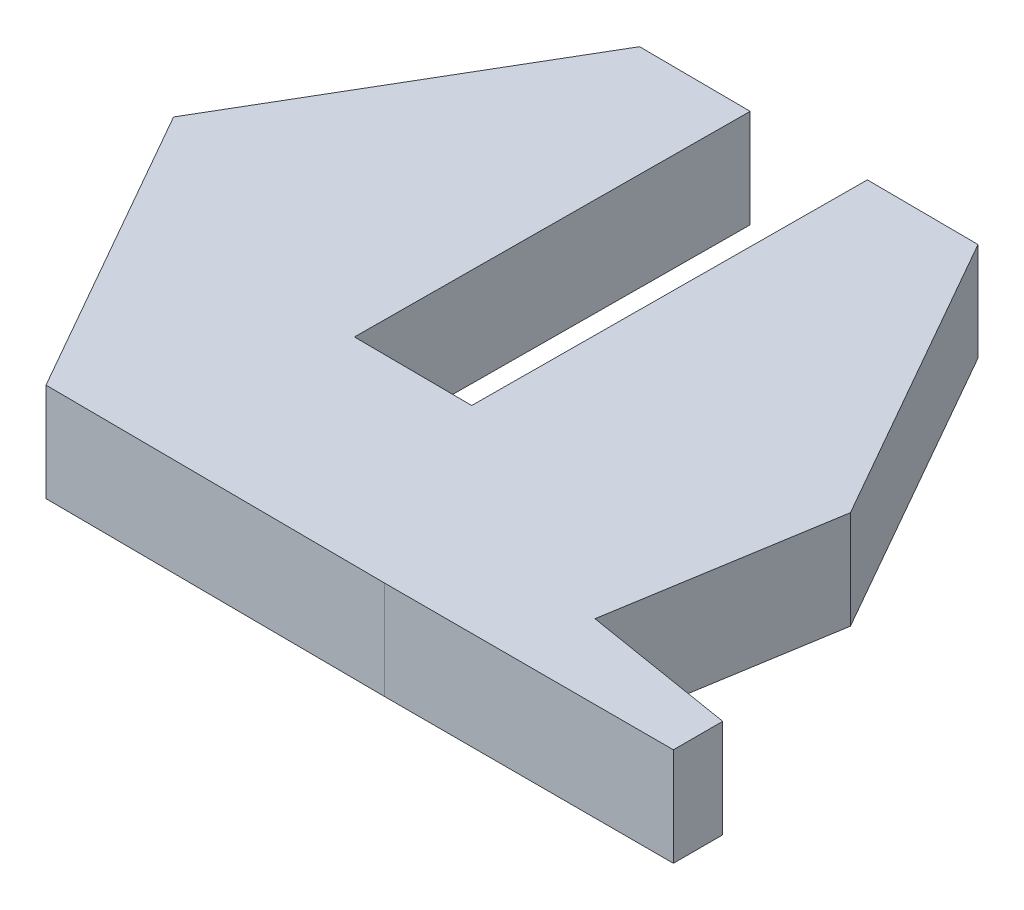
ISO-10303-21;
HEADER;
FILE_DESCRIPTION(('STEP AP214'),'2;1');
FILE_NAME('part.step','',(''),(''),'','','');
FILE_SCHEMA(('AUTOMOTIVE_DESIGN { 1 0 10303 214 1 1 1 1 }'));
ENDSEC;
DATA;
#1=APPLICATION_CONTEXT('core data for automotive mechanical design processes');
#2=APPLICATION_PROTOCOL_DEFINITION('international standard','automotive_design',2000,#1);
#3=PRODUCT_CONTEXT('',#1,'mechanical');
#4=PRODUCT('Part','Part','',(#3));
#5=PRODUCT_RELATED_PRODUCT_CATEGORY('part','',(#4));
#6=PRODUCT_DEFINITION_FORMATION('','',#4);
#7=PRODUCT_DEFINITION_CONTEXT('part definition',#1,'design');
#8=PRODUCT_DEFINITION('design','',#6,#7);
#9=PRODUCT_DEFINITION_SHAPE('','',#8);
#10=(LENGTH_UNIT() NAMED_UNIT(*) SI_UNIT(.MILLI.,.METRE.));
#11=(NAMED_UNIT(*) PLANE_ANGLE_UNIT() SI_UNIT($,.RADIAN.));
#12=(NAMED_UNIT(*) SI_UNIT($,.STERADIAN.) SOLID_ANGLE_UNIT());
#13=UNCERTAINTY_MEASURE_WITH_UNIT(LENGTH_MEASURE(1.E-05),#10,'distance_accuracy_value','');
#14=(GEOMETRIC_REPRESENTATION_CONTEXT(3) GLOBAL_UNCERTAINTY_ASSIGNED_CONTEXT((#13)) GLOBAL_UNIT_ASSIGNED_CONTEXT((#10,
#11,#12)) REPRESENTATION_CONTEXT('',''));
#15=CARTESIAN_POINT('',(0.,0.,0.));
#16=DIRECTION('',(0.,0.,1.));
#17=DIRECTION('',(1.,0.,0.));
#18=AXIS2_PLACEMENT_3D('',#15,#16,#17);
#19=CARTESIAN_POINT('',(5.43989249764885,2.5,-6.81085116172569));
#20=DIRECTION('',(-0.00625685853298923,0.,0.999980425669072));
#21=DIRECTION('',(0.999980425669072,0.,0.00625685853298923));
#22=AXIS2_PLACEMENT_3D('',#19,#20,#21);
#23=PLANE('',#22);
#24=DIRECTION('',(-0.999980425669072,0.,-0.00625685853298923));
#25=VECTOR('',#24,1.);
#26=CARTESIAN_POINT('',(5.43989249764885,0.,-6.81085116172569));
#27=LINE('',#26,#25);
#28=CARTESIAN_POINT('',(5.43989249764885,0.,-6.81085116172569));
#29=VERTEX_POINT('',#28);
#30=CARTESIAN_POINT('',(2.60994789300537,0.,-6.82855807137405));
#31=VERTEX_POINT('',#30);
#32=EDGE_CURVE('E169',#29,#31,#27,.T.);
#33=ORIENTED_EDGE('',*,*,#32,.T.);
#34=DIRECTION('',(0.,-1.,0.));
#35=VECTOR('',#34,1.);
#36=CARTESIAN_POINT('',(2.60994789300537,0.,-6.82855807137405));
#37=LINE('',#36,#35);
#38=CARTESIAN_POINT('',(2.60994789300537,2.5,-6.82855807137405));
#39=VERTEX_POINT('',#38);
#40=EDGE_CURVE('E270',#39,#31,#37,.T.);
#41=ORIENTED_EDGE('',*,*,#40,.F.);
#42=DIRECTION('',(-0.999980425669072,0.,-0.00625685853298923));
#43=VECTOR('',#42,1.);
#44=CARTESIAN_POINT('',(5.43989249764885,2.5,-6.81085116172569));
#45=LINE('',#44,#43);
#46=CARTESIAN_POINT('',(5.43989249764885,2.5,-6.81085116172569));
#47=VERTEX_POINT('',#46);
#48=EDGE_CURVE('E215',#47,#39,#45,.T.);
#49=ORIENTED_EDGE('',*,*,#48,.F.);
#50=DIRECTION('',(0.,-1.,0.));
#51=VECTOR('',#50,1.);
#52=CARTESIAN_POINT('',(5.43989249764885,2.5,-6.81085116172569));
#53=LINE('',#52,#51);
#54=EDGE_CURVE('E48',#47,#29,#53,.T.);
#55=ORIENTED_EDGE('',*,*,#54,.T.);
#56=EDGE_LOOP('',(#33,#41,#49,#55));
#57=FACE_BOUND('',#56,.T.);
#58=ADVANCED_FACE('F39',(#57),#23,.F.);
#59=CARTESIAN_POINT('',(9.7230083182344,2.5,0.716095022979621));
#60=DIRECTION('',(-0.986900559449529,0.,-0.161329742323625));
#61=DIRECTION('',(-0.161329742323625,0.,0.986900559449529));
#62=AXIS2_PLACEMENT_3D('',#59,#60,#61);
#63=PLANE('',#62);
#64=DIRECTION('',(0.161329742323625,0.,-0.986900559449529));
#65=VECTOR('',#64,1.);
#66=CARTESIAN_POINT('',(9.7230083182344,0.,0.716095022979621));
#67=LINE('',#66,#65);
#68=CARTESIAN_POINT('',(8.81032447453926,0.,6.29924530246391));
#69=VERTEX_POINT('',#68);
#70=CARTESIAN_POINT('',(9.7230083182344,0.,0.716095022979621));
#71=VERTEX_POINT('',#70);
#72=EDGE_CURVE('E160',#69,#71,#67,.T.);
#73=ORIENTED_EDGE('',*,*,#72,.T.);
#74=DIRECTION('',(0.,-1.,0.));
#75=VECTOR('',#74,1.);
#76=CARTESIAN_POINT('',(9.7230083182344,2.5,0.716095022979621));
#77=LINE('',#76,#75);
#78=CARTESIAN_POINT('',(9.7230083182344,2.5,0.716095022979621));
#79=VERTEX_POINT('',#78);
#80=EDGE_CURVE('E11',#79,#71,#77,.T.);
#81=ORIENTED_EDGE('',*,*,#80,.F.);
#82=DIRECTION('',(0.161329742323625,0.,-0.986900559449529));
#83=VECTOR('',#82,1.);
#84=CARTESIAN_POINT('',(9.7230083182344,2.5,0.716095022979621));
#85=LINE('',#84,#83);
#86=CARTESIAN_POINT('',(8.81032447453926,2.5,6.29924530246391));
#87=VERTEX_POINT('',#86);
#88=EDGE_CURVE('E189',#87,#79,#85,.T.);
#89=ORIENTED_EDGE('',*,*,#88,.F.);
#90=DIRECTION('',(0.,-1.,0.));
#91=VECTOR('',#90,1.);
#92=CARTESIAN_POINT('',(8.81032447453926,2.5,6.29924530246391));
#93=LINE('',#92,#91);
#94=EDGE_CURVE('E156',#87,#69,#93,.T.);
#95=ORIENTED_EDGE('',*,*,#94,.T.);
#96=EDGE_LOOP('',(#73,#81,#89,#95));
#97=FACE_BOUND('',#96,.T.);
#98=ADVANCED_FACE('F41',(#97),#63,.F.);
#99=CARTESIAN_POINT('',(9.7230083182344,2.5,0.716095022979621));
#100=DIRECTION('',(-0.869136881183087,0.,0.494571614397082));
#101=DIRECTION('',(0.494571614397082,0.,0.869136881183087));
#102=AXIS2_PLACEMENT_3D('',#99,#100,#101);
#103=PLANE('',#102);
#104=DIRECTION('',(-0.494571614397082,0.,-0.869136881183087));
#105=VECTOR('',#104,1.);
#106=CARTESIAN_POINT('',(9.7230083182344,0.,0.716095022979621));
#107=LINE('',#106,#105);
#108=EDGE_CURVE('E164',#71,#29,#107,.T.);
#109=ORIENTED_EDGE('',*,*,#108,.T.);
#110=ORIENTED_EDGE('',*,*,#54,.F.);
#111=DIRECTION('',(-0.494571614397082,0.,-0.869136881183087));
#112=VECTOR('',#111,1.);
#113=CARTESIAN_POINT('',(9.7230083182344,2.5,0.716095022979621));
#114=LINE('',#113,#112);
#115=EDGE_CURVE('E108',#79,#47,#114,.T.);
#116=ORIENTED_EDGE('',*,*,#115,.F.);
#117=ORIENTED_EDGE('',*,*,#80,.T.);
#118=EDGE_LOOP('',(#109,#110,#116,#117));
#119=FACE_BOUND('',#118,.T.);
#120=ADVANCED_FACE('F326',(#119),#103,.F.);
#121=CARTESIAN_POINT('',(-0.389993384001841,2.5,-6.84732864697302));
#122=VERTEX_POINT('',#121);
#123=CARTESIAN_POINT('',(-3.22019202151707,2.5,-6.86503714610023));
#124=VERTEX_POINT('',#123);
#125=EDGE_CURVE('E245',#122,#124,#45,.T.);
#126=ORIENTED_EDGE('',*,*,#125,.F.);
#127=DIRECTION('',(0.,1.,0.));
#128=VECTOR('',#127,1.);
#129=CARTESIAN_POINT('',(-0.389993384001841,0.,-6.84732864697302));
#130=LINE('',#129,#128);
#131=CARTESIAN_POINT('',(-0.389993384001841,0.,-6.84732864697302));
#132=VERTEX_POINT('',#131);
#133=EDGE_CURVE('E266',#132,#122,#130,.T.);
#134=ORIENTED_EDGE('',*,*,#133,.F.);
#135=CARTESIAN_POINT('',(-3.22019202151707,0.,-6.86503714610023));
#136=VERTEX_POINT('',#135);
#137=EDGE_CURVE('E168',#132,#136,#27,.T.);
#138=ORIENTED_EDGE('',*,*,#137,.T.);
#139=DIRECTION('',(0.,-1.,0.));
#140=VECTOR('',#139,1.);
#141=CARTESIAN_POINT('',(-3.22019202151707,2.5,-6.86503714610023));
#142=LINE('',#141,#140);
#143=EDGE_CURVE('E204',#124,#136,#142,.T.);
#144=ORIENTED_EDGE('',*,*,#143,.F.);
#145=EDGE_LOOP('',(#126,#134,#138,#144));
#146=FACE_BOUND('',#145,.T.);
#147=ADVANCED_FACE('F291',(#146),#23,.F.);
#148=CARTESIAN_POINT('',(-3.22019202151707,2.5,-6.86503714610023));
#149=DIRECTION('',(0.862880022650098,0.,0.50540881127199));
#150=DIRECTION('',(0.50540881127199,0.,-0.862880022650098));
#151=AXIS2_PLACEMENT_3D('',#148,#149,#150);
#152=PLANE('',#151);
#153=DIRECTION('',(-0.50540881127199,0.,0.862880022650098));
#154=VECTOR('',#153,1.);
#155=CARTESIAN_POINT('',(-3.22019202151707,0.,-6.86503714610023));
#156=LINE('',#155,#154);
#157=CARTESIAN_POINT('',(-7.59716072009746,0.,0.607723054230536));
#158=VERTEX_POINT('',#157);
#159=EDGE_CURVE('E173',#136,#158,#156,.T.);
#160=ORIENTED_EDGE('',*,*,#159,.T.);
#161=DIRECTION('',(0.,-1.,0.));
#162=VECTOR('',#161,1.);
#163=CARTESIAN_POINT('',(-7.59716072009746,2.5,0.607723054230536));
#164=LINE('',#163,#162);
#165=CARTESIAN_POINT('',(-7.59716072009746,2.5,0.607723054230536));
#166=VERTEX_POINT('',#165);
#167=EDGE_CURVE('E200',#166,#158,#164,.T.);
#168=ORIENTED_EDGE('',*,*,#167,.F.);
#169=DIRECTION('',(-0.50540881127199,0.,0.862880022650098));
#170=VECTOR('',#169,1.);
#171=CARTESIAN_POINT('',(-3.22019202151707,2.5,-6.86503714610023));
#172=LINE('',#171,#170);
#173=EDGE_CURVE('E248',#124,#166,#172,.T.);
#174=ORIENTED_EDGE('',*,*,#173,.F.);
#175=ORIENTED_EDGE('',*,*,#143,.T.);
#176=EDGE_LOOP('',(#160,#168,#174,#175));
#177=FACE_BOUND('',#176,.T.);
#178=ADVANCED_FACE('F298',(#177),#152,.F.);
#179=CARTESIAN_POINT('',(-7.59716072009746,2.5,0.607723054230536));
#180=DIRECTION('',(0.869136881183088,0.,-0.494571614397082));
#181=DIRECTION('',(-0.494571614397082,0.,-0.869136881183088));
#182=AXIS2_PLACEMENT_3D('',#179,#180,#181);
#183=PLANE('',#182);
#184=DIRECTION('',(0.494571614397082,0.,0.869136881183088));
#185=VECTOR('',#184,1.);
#186=CARTESIAN_POINT('',(-7.59716072009746,0.,0.607723054230536));
#187=LINE('',#186,#185);
#188=CARTESIAN_POINT('',(-3.31404489951191,0.,8.13466923893585));
#189=VERTEX_POINT('',#188);
#190=EDGE_CURVE('E176',#158,#189,#187,.T.);
#191=ORIENTED_EDGE('',*,*,#190,.T.);
#192=DIRECTION('',(0.,-1.,0.));
#193=VECTOR('',#192,1.);
#194=CARTESIAN_POINT('',(-3.31404489951191,2.5,8.13466923893585));
#195=LINE('',#194,#193);
#196=CARTESIAN_POINT('',(-3.31404489951191,2.5,8.13466923893585));
#197=VERTEX_POINT('',#196);
#198=EDGE_CURVE('E196',#197,#189,#195,.T.);
#199=ORIENTED_EDGE('',*,*,#198,.F.);
#200=DIRECTION('',(0.494571614397082,0.,0.869136881183088));
#201=VECTOR('',#200,1.);
#202=CARTESIAN_POINT('',(-7.59716072009746,2.5,0.607723054230536));
#203=LINE('',#202,#201);
#204=EDGE_CURVE('E251',#166,#197,#203,.T.);
#205=ORIENTED_EDGE('',*,*,#204,.F.);
#206=ORIENTED_EDGE('',*,*,#167,.T.);
#207=EDGE_LOOP('',(#191,#199,#205,#206));
#208=FACE_BOUND('',#207,.T.);
#209=ADVANCED_FACE('F301',(#208),#183,.F.);
#210=CARTESIAN_POINT('',(-3.31404489951191,2.5,8.13466923893585));
#211=DIRECTION('',(0.00625685853298943,0.,-0.999980425669072));
#212=DIRECTION('',(-0.999980425669072,0.,-0.00625685853298943));
#213=AXIS2_PLACEMENT_3D('',#210,#211,#212);
#214=PLANE('',#213);
#215=DIRECTION('',(0.999980425669072,0.,0.00625685853298943));
#216=VECTOR('',#215,1.);
#217=CARTESIAN_POINT('',(-3.31404489951191,0.,8.13466923893585));
#218=LINE('',#217,#216);
#219=CARTESIAN_POINT('',(5.34603961965416,0.,8.18885522331039));
#220=VERTEX_POINT('',#219);
#221=EDGE_CURVE('E179',#189,#220,#218,.T.);
#222=ORIENTED_EDGE('',*,*,#221,.T.);
#223=DIRECTION('',(0.,-1.,0.));
#224=VECTOR('',#223,1.);
#225=CARTESIAN_POINT('',(5.34603961965416,2.5,8.18885522331039));
#226=LINE('',#225,#224);
#227=CARTESIAN_POINT('',(5.34603961965416,2.5,8.18885522331039));
#228=VERTEX_POINT('',#227);
#229=EDGE_CURVE('E149',#228,#220,#226,.T.);
#230=ORIENTED_EDGE('',*,*,#229,.F.);
#231=DIRECTION('',(0.999980425669072,0.,0.00625685853298943));
#232=VECTOR('',#231,1.);
#233=CARTESIAN_POINT('',(-3.31404489951191,2.5,8.13466923893585));
#234=LINE('',#233,#232);
#235=EDGE_CURVE('E135',#197,#228,#234,.T.);
#236=ORIENTED_EDGE('',*,*,#235,.F.);
#237=ORIENTED_EDGE('',*,*,#198,.T.);
#238=EDGE_LOOP('',(#222,#230,#236,#237));
#239=FACE_BOUND('',#238,.T.);
#240=ADVANCED_FACE('F304',(#239),#214,.F.);
#241=CARTESIAN_POINT('',(12.6941052252956,2.5,8.18885522331039));
#242=DIRECTION('',(0.,0.,-1.));
#243=DIRECTION('',(-1.,0.,0.));
#244=AXIS2_PLACEMENT_3D('',#241,#242,#243);
#245=PLANE('',#244);
#246=DIRECTION('',(1.,0.,0.));
#247=VECTOR('',#246,1.);
#248=CARTESIAN_POINT('',(12.6941052252956,0.,8.18885522331039));
#249=LINE('',#248,#247);
#250=CARTESIAN_POINT('',(12.6941052252956,0.,8.18885522331039));
#251=VERTEX_POINT('',#250);
#252=EDGE_CURVE('E145',#220,#251,#249,.T.);
#253=ORIENTED_EDGE('',*,*,#252,.T.);
#254=DIRECTION('',(0.,-1.,0.));
#255=VECTOR('',#254,1.);
#256=CARTESIAN_POINT('',(12.6941052252956,2.5,8.18885522331039));
#257=LINE('',#256,#255);
#258=CARTESIAN_POINT('',(12.6941052252956,2.5,8.18885522331039));
#259=VERTEX_POINT('',#258);
#260=EDGE_CURVE('E142',#259,#251,#257,.T.);
#261=ORIENTED_EDGE('',*,*,#260,.F.);
#262=DIRECTION('',(1.,0.,0.));
#263=VECTOR('',#262,1.);
#264=CARTESIAN_POINT('',(12.6941052252956,2.5,8.18885522331039));
#265=LINE('',#264,#263);
#266=EDGE_CURVE('E127',#228,#259,#265,.T.);
#267=ORIENTED_EDGE('',*,*,#266,.F.);
#268=ORIENTED_EDGE('',*,*,#229,.T.);
#269=EDGE_LOOP('',(#253,#261,#267,#268));
#270=FACE_BOUND('',#269,.T.);
#271=ADVANCED_FACE('F143',(#270),#245,.F.);
#272=CARTESIAN_POINT('',(12.6941052252956,2.5,6.93413130162724));
#273=DIRECTION('',(-1.,0.,0.));
#274=DIRECTION('',(0.,0.,1.));
#275=AXIS2_PLACEMENT_3D('',#272,#273,#274);
#276=PLANE('',#275);
#277=DIRECTION('',(0.,0.,-1.));
#278=VECTOR('',#277,1.);
#279=CARTESIAN_POINT('',(12.6941052252956,0.,6.93413130162724));
#280=LINE('',#279,#278);
#281=CARTESIAN_POINT('',(12.6941052252956,0.,6.93413130162724));
#282=VERTEX_POINT('',#281);
#283=EDGE_CURVE('E184',#251,#282,#280,.T.);
#284=ORIENTED_EDGE('',*,*,#283,.T.);
#285=DIRECTION('',(0.,-1.,0.));
#286=VECTOR('',#285,1.);
#287=CARTESIAN_POINT('',(12.6941052252956,2.5,6.93413130162724));
#288=LINE('',#287,#286);
#289=CARTESIAN_POINT('',(12.6941052252956,2.5,6.93413130162724));
#290=VERTEX_POINT('',#289);
#291=EDGE_CURVE('E150',#290,#282,#288,.T.);
#292=ORIENTED_EDGE('',*,*,#291,.F.);
#293=DIRECTION('',(0.,0.,-1.));
#294=VECTOR('',#293,1.);
#295=CARTESIAN_POINT('',(12.6941052252956,2.5,6.93413130162724));
#296=LINE('',#295,#294);
#297=EDGE_CURVE('E132',#259,#290,#296,.T.);
#298=ORIENTED_EDGE('',*,*,#297,.F.);
#299=ORIENTED_EDGE('',*,*,#260,.T.);
#300=EDGE_LOOP('',(#284,#292,#298,#299));
#301=FACE_BOUND('',#300,.T.);
#302=ADVANCED_FACE('F152',(#301),#276,.F.);
#303=CARTESIAN_POINT('',(8.81032447453926,2.5,6.29924530246391));
#304=DIRECTION('',(-0.161329742323625,0.,0.986900559449529));
#305=DIRECTION('',(0.986900559449529,0.,0.161329742323625));
#306=AXIS2_PLACEMENT_3D('',#303,#304,#305);
#307=PLANE('',#306);
#308=DIRECTION('',(-0.986900559449529,0.,-0.161329742323625));
#309=VECTOR('',#308,1.);
#310=CARTESIAN_POINT('',(8.81032447453926,0.,6.29924530246391));
#311=LINE('',#310,#309);
#312=EDGE_CURVE('E100',#282,#69,#311,.T.);
#313=ORIENTED_EDGE('',*,*,#312,.T.);
#314=ORIENTED_EDGE('',*,*,#94,.F.);
#315=DIRECTION('',(-0.986900559449529,0.,-0.161329742323625));
#316=VECTOR('',#315,1.);
#317=CARTESIAN_POINT('',(8.81032447453926,2.5,6.29924530246391));
#318=LINE('',#317,#316);
#319=EDGE_CURVE('E64',#290,#87,#318,.T.);
#320=ORIENTED_EDGE('',*,*,#319,.F.);
#321=ORIENTED_EDGE('',*,*,#291,.T.);
#322=EDGE_LOOP('',(#313,#314,#320,#321));
#323=FACE_BOUND('',#322,.T.);
#324=ADVANCED_FACE('F305',(#323),#307,.F.);
#325=CARTESIAN_POINT('',(0.,2.5,0.));
#326=DIRECTION('',(0.,1.,0.));
#327=DIRECTION('',(0.,0.,1.));
#328=AXIS2_PLACEMENT_3D('',#325,#326,#327);
#329=PLANE('',#328);
#330=DIRECTION('',(0.00625685853298923,0.,-0.999980425669072));
#331=VECTOR('',#330,1.);
#332=CARTESIAN_POINT('',(2.54737930767548,2.5,3.17124618531667));
#333=LINE('',#332,#331);
#334=CARTESIAN_POINT('',(2.54737930767548,2.5,3.17124618531667));
#335=VERTEX_POINT('',#334);
#336=EDGE_CURVE('E165',#335,#39,#333,.T.);
#337=ORIENTED_EDGE('',*,*,#336,.F.);
#338=DIRECTION('',(0.999980425669072,0.,0.0062568585329894));
#339=VECTOR('',#338,1.);
#340=CARTESIAN_POINT('',(2.54737930767548,2.5,3.17124618531667));
#341=LINE('',#340,#339);
#342=CARTESIAN_POINT('',(-0.452561969331734,2.5,3.1524756097177));
#343=VERTEX_POINT('',#342);
#344=EDGE_CURVE('E230',#343,#335,#341,.T.);
#345=ORIENTED_EDGE('',*,*,#344,.F.);
#346=DIRECTION('',(0.00625685853298923,0.,-0.999980425669072));
#347=VECTOR('',#346,1.);
#348=CARTESIAN_POINT('',(-0.452561969331734,2.5,3.1524756097177));
#349=LINE('',#348,#347);
#350=EDGE_CURVE('E235',#343,#122,#349,.T.);
#351=ORIENTED_EDGE('',*,*,#350,.T.);
#352=ORIENTED_EDGE('',*,*,#125,.T.);
#353=ORIENTED_EDGE('',*,*,#173,.T.);
#354=ORIENTED_EDGE('',*,*,#204,.T.);
#355=ORIENTED_EDGE('',*,*,#235,.T.);
#356=ORIENTED_EDGE('',*,*,#266,.T.);
#357=ORIENTED_EDGE('',*,*,#297,.T.);
#358=ORIENTED_EDGE('',*,*,#319,.T.);
#359=ORIENTED_EDGE('',*,*,#88,.T.);
#360=ORIENTED_EDGE('',*,*,#115,.T.);
#361=ORIENTED_EDGE('',*,*,#48,.T.);
#362=EDGE_LOOP('',(#337,#345,#351,#352,#353,#354,#355,#356,#357,#358,#359,#360,#361));
#363=FACE_BOUND('',#362,.T.);
#364=ADVANCED_FACE('F130',(#363),#329,.T.);
#365=CARTESIAN_POINT('',(0.,0.,0.));
#366=DIRECTION('',(0.,1.,0.));
#367=DIRECTION('',(0.,0.,1.));
#368=AXIS2_PLACEMENT_3D('',#365,#366,#367);
#369=PLANE('',#368);
#370=DIRECTION('',(-0.999980425669072,0.,-0.0062568585329894));
#371=VECTOR('',#370,1.);
#372=CARTESIAN_POINT('',(2.54737930767548,0.,3.17124618531667));
#373=LINE('',#372,#371);
#374=CARTESIAN_POINT('',(2.54737930767548,0.,3.17124618531667));
#375=VERTEX_POINT('',#374);
#376=CARTESIAN_POINT('',(-0.452561969331734,0.,3.1524756097177));
#377=VERTEX_POINT('',#376);
#378=EDGE_CURVE('E223',#375,#377,#373,.T.);
#379=ORIENTED_EDGE('',*,*,#378,.F.);
#380=DIRECTION('',(0.00625685853298923,0.,-0.999980425669072));
#381=VECTOR('',#380,1.);
#382=CARTESIAN_POINT('',(2.54737930767548,0.,3.17124618531667));
#383=LINE('',#382,#381);
#384=EDGE_CURVE('E221',#375,#31,#383,.T.);
#385=ORIENTED_EDGE('',*,*,#384,.T.);
#386=ORIENTED_EDGE('',*,*,#32,.F.);
#387=ORIENTED_EDGE('',*,*,#108,.F.);
#388=ORIENTED_EDGE('',*,*,#72,.F.);
#389=ORIENTED_EDGE('',*,*,#312,.F.);
#390=ORIENTED_EDGE('',*,*,#283,.F.);
#391=ORIENTED_EDGE('',*,*,#252,.F.);
#392=ORIENTED_EDGE('',*,*,#221,.F.);
#393=ORIENTED_EDGE('',*,*,#190,.F.);
#394=ORIENTED_EDGE('',*,*,#159,.F.);
#395=ORIENTED_EDGE('',*,*,#137,.F.);
#396=DIRECTION('',(0.00625685853298923,0.,-0.999980425669072));
#397=VECTOR('',#396,1.);
#398=CARTESIAN_POINT('',(-0.452561969331734,0.,3.1524756097177));
#399=LINE('',#398,#397);
#400=EDGE_CURVE('E229',#377,#132,#399,.T.);
#401=ORIENTED_EDGE('',*,*,#400,.F.);
#402=EDGE_LOOP('',(#379,#385,#386,#387,#388,#389,#390,#391,#392,#393,#394,#395,#401));
#403=FACE_BOUND('',#402,.T.);
#404=ADVANCED_FACE('F219',(#403),#369,.F.);
#405=CARTESIAN_POINT('',(2.54737930767548,0.,3.17124618531667));
#406=DIRECTION('',(0.999980425669072,0.,0.00625685853298923));
#407=DIRECTION('',(0.00625685853298923,0.,-0.999980425669072));
#408=AXIS2_PLACEMENT_3D('',#405,#406,#407);
#409=PLANE('',#408);
#410=ORIENTED_EDGE('',*,*,#40,.T.);
#411=ORIENTED_EDGE('',*,*,#384,.F.);
#412=DIRECTION('',(0.,-1.,0.));
#413=VECTOR('',#412,1.);
#414=CARTESIAN_POINT('',(2.54737930767548,0.,3.17124618531667));
#415=LINE('',#414,#413);
#416=EDGE_CURVE('E55',#335,#375,#415,.T.);
#417=ORIENTED_EDGE('',*,*,#416,.F.);
#418=ORIENTED_EDGE('',*,*,#336,.T.);
#419=EDGE_LOOP('',(#410,#411,#417,#418));
#420=FACE_BOUND('',#419,.T.);
#421=ADVANCED_FACE('F309',(#420),#409,.F.);
#422=CARTESIAN_POINT('',(-0.452561969331734,0.,3.1524756097177));
#423=DIRECTION('',(-0.999980425669072,0.,-0.00625685853298923));
#424=DIRECTION('',(-0.00625685853298923,0.,0.999980425669072));
#425=AXIS2_PLACEMENT_3D('',#422,#423,#424);
#426=PLANE('',#425);
#427=ORIENTED_EDGE('',*,*,#133,.T.);
#428=ORIENTED_EDGE('',*,*,#350,.F.);
#429=DIRECTION('',(0.,1.,0.));
#430=VECTOR('',#429,1.);
#431=CARTESIAN_POINT('',(-0.452561969331734,0.,3.1524756097177));
#432=LINE('',#431,#430);
#433=EDGE_CURVE('E237',#377,#343,#432,.T.);
#434=ORIENTED_EDGE('',*,*,#433,.F.);
#435=ORIENTED_EDGE('',*,*,#400,.T.);
#436=EDGE_LOOP('',(#427,#428,#434,#435));
#437=FACE_BOUND('',#436,.T.);
#438=ADVANCED_FACE('F288',(#437),#426,.F.);
#439=CARTESIAN_POINT('',(-0.0197419248450779,0.,3.15518375651646));
#440=DIRECTION('',(-0.0062568585329894,0.,0.999980425669072));
#441=DIRECTION('',(0.999980425669072,0.,0.0062568585329894));
#442=AXIS2_PLACEMENT_3D('',#439,#440,#441);
#443=PLANE('',#442);
#444=ORIENTED_EDGE('',*,*,#416,.T.);
#445=ORIENTED_EDGE('',*,*,#378,.T.);
#446=ORIENTED_EDGE('',*,*,#433,.T.);
#447=ORIENTED_EDGE('',*,*,#344,.T.);
#448=EDGE_LOOP('',(#444,#445,#446,#447));
#449=FACE_BOUND('',#448,.T.);
#450=ADVANCED_FACE('F280',(#449),#443,.F.);
#451=CLOSED_SHELL('',(#58,#98,#120,#147,#178,#209,#240,#271,#302,#324,#364,#404,#421,#438,#450));
#452=MANIFOLD_SOLID_BREP('B2',#451);
#453=ADVANCED_BREP_SHAPE_REPRESENTATION('',(#18,#452),#14);
#454=SHAPE_DEFINITION_REPRESENTATION(#9,#453);
ENDSEC;
END-ISO-10303-21;
